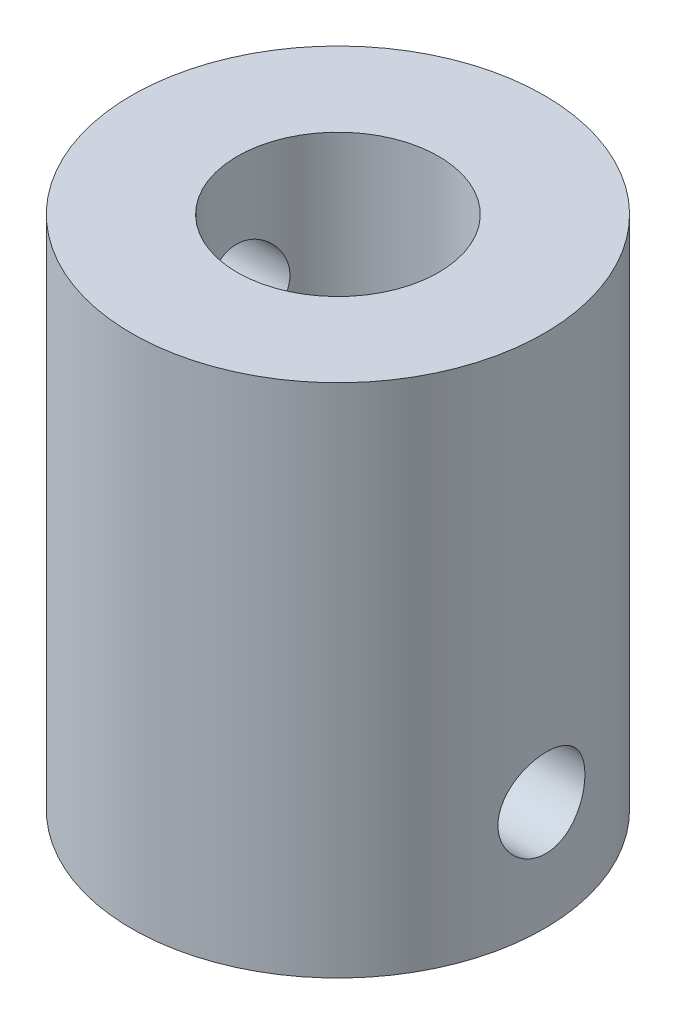
ISO-10303-21;
HEADER;
FILE_DESCRIPTION(('STEP AP214'),'2;1');
FILE_NAME('part.step','',(''),(''),'','','');
FILE_SCHEMA(('AUTOMOTIVE_DESIGN { 1 0 10303 214 1 1 1 1 }'));
ENDSEC;
DATA;
#1=APPLICATION_CONTEXT('core data for automotive mechanical design processes');
#2=APPLICATION_PROTOCOL_DEFINITION('international standard','automotive_design',2000,#1);
#3=PRODUCT_CONTEXT('',#1,'mechanical');
#4=PRODUCT('Part','Part','',(#3));
#5=PRODUCT_RELATED_PRODUCT_CATEGORY('part','',(#4));
#6=PRODUCT_DEFINITION_FORMATION('','',#4);
#7=PRODUCT_DEFINITION_CONTEXT('part definition',#1,'design');
#8=PRODUCT_DEFINITION('design','',#6,#7);
#9=PRODUCT_DEFINITION_SHAPE('','',#8);
#10=(LENGTH_UNIT() NAMED_UNIT(*) SI_UNIT(.MILLI.,.METRE.));
#11=(NAMED_UNIT(*) PLANE_ANGLE_UNIT() SI_UNIT($,.RADIAN.));
#12=(NAMED_UNIT(*) SI_UNIT($,.STERADIAN.) SOLID_ANGLE_UNIT());
#13=UNCERTAINTY_MEASURE_WITH_UNIT(LENGTH_MEASURE(1.E-05),#10,'distance_accuracy_value','');
#14=(GEOMETRIC_REPRESENTATION_CONTEXT(3) GLOBAL_UNCERTAINTY_ASSIGNED_CONTEXT((#13)) GLOBAL_UNIT_ASSIGNED_CONTEXT((#10,
#11,#12)) REPRESENTATION_CONTEXT('',''));
#15=CARTESIAN_POINT('',(0.,0.,0.));
#16=DIRECTION('',(0.,0.,1.));
#17=DIRECTION('',(1.,0.,0.));
#18=AXIS2_PLACEMENT_3D('',#15,#16,#17);
#19=CARTESIAN_POINT('',(0.,-15.875,0.));
#20=DIRECTION('',(0.,1.,0.));
#21=DIRECTION('',(0.,0.,1.));
#22=AXIS2_PLACEMENT_3D('',#19,#20,#21);
#23=CYLINDRICAL_SURFACE('',#22,6.35);
#24=CARTESIAN_POINT('',(6.21738177406236,-12.5453221322497,1.29099336774329));
#25=CARTESIAN_POINT('',(6.21738326186655,-12.4702792930117,1.2909907076367));
#26=CARTESIAN_POINT('',(6.21869592187058,-12.3952041913741,1.28471345774189));
#27=CARTESIAN_POINT('',(6.22379045246098,-12.2471854645976,1.25979687149708));
#28=CARTESIAN_POINT('',(6.22757416801804,-12.1742434746581,1.24114829814893));
#29=CARTESIAN_POINT('',(6.23714750991711,-12.0326536198847,1.19210333315079));
#30=CARTESIAN_POINT('',(6.24293499962672,-11.9640012726663,1.16171945093561));
#31=CARTESIAN_POINT('',(6.25583609295879,-11.8327581574019,1.0901067360321));
#32=CARTESIAN_POINT('',(6.26294965467079,-11.770167197881,1.04887824607021));
#33=CARTESIAN_POINT('',(6.27779468396373,-11.6518188811392,0.956048613447214));
#34=CARTESIAN_POINT('',(6.28553356927118,-11.5961728010964,0.904306766010363));
#35=CARTESIAN_POINT('',(6.30063985111885,-11.494267426295,0.792230481802911));
#36=CARTESIAN_POINT('',(6.30800721966741,-11.4480088380387,0.73189539888681));
#37=CARTESIAN_POINT('',(6.32157833558068,-11.3657540041882,0.603607869396303));
#38=CARTESIAN_POINT('',(6.32776978282993,-11.3298643862855,0.535585639147176));
#39=CARTESIAN_POINT('',(6.33813990311477,-11.2700555460559,0.39432394261325));
#40=CARTESIAN_POINT('',(6.34231879015412,-11.2461350509925,0.321085031990501));
#41=CARTESIAN_POINT('',(6.34808099807122,-11.2112923359577,0.172629986919483));
#42=CARTESIAN_POINT('',(6.34970203279303,-11.2001819130496,0.0974595184543244));
#43=CARTESIAN_POINT('',(6.3502225308924,-11.1906866866706,-0.053686497890084));
#44=CARTESIAN_POINT('',(6.34912229018535,-11.1923004995897,-0.129661957338898));
#45=CARTESIAN_POINT('',(6.34430217633988,-11.2080669538146,-0.278965828647051));
#46=CARTESIAN_POINT('',(6.34062487461048,-11.2220167793994,-0.352317172565448));
#47=CARTESIAN_POINT('',(6.33103849154393,-11.2617365539936,-0.495590567584669));
#48=CARTESIAN_POINT('',(6.32512931279723,-11.2875070189214,-0.565512468858087));
#49=CARTESIAN_POINT('',(6.31160990517074,-11.3503186001684,-0.700513687389734));
#50=CARTESIAN_POINT('',(6.30398805023243,-11.3874374039617,-0.765555650680673));
#51=CARTESIAN_POINT('',(6.28783189586731,-11.4718342101457,-0.888551494520052));
#52=CARTESIAN_POINT('',(6.27929747823784,-11.5191135294132,-0.946504454752822));
#53=CARTESIAN_POINT('',(6.26201157221647,-11.6235961544228,-1.05488722654952));
#54=CARTESIAN_POINT('',(6.25325912496787,-11.6809769723287,-1.10514590506409));
#55=CARTESIAN_POINT('',(6.23664279521635,-11.8034514460884,-1.1953649137026));
#56=CARTESIAN_POINT('',(6.22877893435493,-11.8685452897137,-1.23532499303466));
#57=CARTESIAN_POINT('',(6.214789312092,-12.0048649231218,-1.30388932195032));
#58=CARTESIAN_POINT('',(6.20866828157541,-12.0761067319225,-1.3324627449862));
#59=CARTESIAN_POINT('',(6.19889805673559,-12.2225440782345,-1.37720468359972));
#60=CARTESIAN_POINT('',(6.19524849261453,-12.2977390224352,-1.39337505505539));
#61=CARTESIAN_POINT('',(6.19089466555298,-12.4483885629586,-1.41259316675393));
#62=CARTESIAN_POINT('',(6.19013475457655,-12.5238099544007,-1.41588887758296));
#63=CARTESIAN_POINT('',(6.19149359428071,-12.6741257884309,-1.40993479896112));
#64=CARTESIAN_POINT('',(6.19361215819128,-12.749020264891,-1.40068582347301));
#65=CARTESIAN_POINT('',(6.20044475689727,-12.8953004715963,-1.37011790690533));
#66=CARTESIAN_POINT('',(6.20512968128383,-12.9667159488616,-1.3489342662147));
#67=CARTESIAN_POINT('',(6.21655858579892,-13.1049763898437,-1.29524057701489));
#68=CARTESIAN_POINT('',(6.22330275453617,-13.1718209342164,-1.26272949097255));
#69=CARTESIAN_POINT('',(6.23824061612408,-13.30012124665,-1.1867473869029));
#70=CARTESIAN_POINT('',(6.24645410608942,-13.3614836697538,-1.14312271124506));
#71=CARTESIAN_POINT('',(6.26339086613724,-13.4760946954109,-1.04634726376692));
#72=CARTESIAN_POINT('',(6.27211419601588,-13.5293423435766,-0.993195373037772));
#73=CARTESIAN_POINT('',(6.28931779645379,-13.6271698489464,-0.877747464435722));
#74=CARTESIAN_POINT('',(6.29779108997635,-13.6715807154957,-0.815307013208527));
#75=CARTESIAN_POINT('',(6.31343375575425,-13.7492686262381,-0.683695285842192));
#76=CARTESIAN_POINT('',(6.32060318713189,-13.7825461753176,-0.614524315110042));
#77=CARTESIAN_POINT('',(6.33284841238688,-13.8367840054222,-0.47182870186883));
#78=CARTESIAN_POINT('',(6.33793700362864,-13.8578199230631,-0.398333951453581));
#79=CARTESIAN_POINT('',(6.34556855147914,-13.8872147258775,-0.248726196795455));
#80=CARTESIAN_POINT('',(6.34811185802466,-13.8955753537862,-0.172613553960522));
#81=CARTESIAN_POINT('',(6.35040412025656,-13.8993072952895,-0.0215362150461854));
#82=CARTESIAN_POINT('',(6.35020718148454,-13.8949314598081,0.0534215268750214));
#83=CARTESIAN_POINT('',(6.34723343966858,-13.8738779699891,0.201532728771565));
#84=CARTESIAN_POINT('',(6.34445667841879,-13.8572005149434,0.274686217956795));
#85=CARTESIAN_POINT('',(6.33669756266551,-13.8121356782574,0.416925760686592));
#86=CARTESIAN_POINT('',(6.33172163731786,-13.7837824465873,0.486023010286181));
#87=CARTESIAN_POINT('',(6.32015417960372,-13.7162048806108,0.618530436011767));
#88=CARTESIAN_POINT('',(6.31356249930294,-13.6769795508405,0.681940090669888));
#89=CARTESIAN_POINT('',(6.29938396433424,-13.5879377986203,0.80250689924097));
#90=CARTESIAN_POINT('',(6.29178126038325,-13.5379425749467,0.859530153004304));
#91=CARTESIAN_POINT('',(6.27655359761027,-13.4291430406913,0.964465159692942));
#92=CARTESIAN_POINT('',(6.26892863389397,-13.3703366230238,1.01237472695855));
#93=CARTESIAN_POINT('',(6.25445297993725,-13.2446981833297,1.09829184678259));
#94=CARTESIAN_POINT('',(6.24761319143143,-13.1777748130402,1.13616777118831));
#95=CARTESIAN_POINT('',(6.23565741707973,-13.0383866487961,1.20005887447763));
#96=CARTESIAN_POINT('',(6.23053994001416,-12.9659267155898,1.22608432072501));
#97=CARTESIAN_POINT('',(6.22360171398538,-12.8353565593221,1.26075750965509));
#98=CARTESIAN_POINT('',(6.22128490724863,-12.777966651088,1.27207456724318));
#99=CARTESIAN_POINT('',(6.21817439147064,-12.6621650293446,1.28719336704435));
#100=CARTESIAN_POINT('',(6.21738061560104,-12.6037533607822,1.29099543900415));
#101=CARTESIAN_POINT('',(6.21738177406236,-12.5453221322497,1.29099336774329));
#102=B_SPLINE_CURVE_WITH_KNOTS('',3,(#24,#25,#26,#27,#28,#29,#30,#31,#32,#33,#34,#35,#36,#37,
#38,#39,#40,#41,#42,#43,#44,#45,#46,#47,#48,#49,#50,#51,#52,#53,#54,#55,#56,#57,#58,#59,#60,#61,
#62,#63,#64,#65,#66,#67,#68,#69,#70,#71,#72,#73,#74,#75,#76,#77,#78,#79,#80,#81,#82,#83,#84,#85,
#86,#87,#88,#89,#90,#91,#92,#93,#94,#95,#96,#97,#98,#99,#100,#101),.UNSPECIFIED.,.T.,.F.,(4,2,2,
2,2,2,2,2,2,2,2,2,2,2,2,2,2,2,2,2,2,2,2,2,2,2,2,2,2,2,2,2,2,2,2,2,2,2,4),(0.,0.224914436969691,
0.449996994676308,0.674840281381522,0.899676463128612,1.12774753758039,1.3558357702931,
1.58619220951851,1.81652414859101,2.04342715592709,2.27030549058829,2.49352167317423,
2.71674759908275,2.9415372454847,3.16635604385125,3.39561376672705,3.62487707196821,
3.85475690153272,4.08460232728992,4.30999836392226,4.53537977641819,4.75825607317155,
4.98115278956581,5.20731655186001,5.43350689302726,5.66367697281435,5.89383661316975,
6.12255865319632,6.35124924320268,6.57543090537501,6.79960893577978,7.02313588295605,
7.24668330332533,7.47427578777838,7.70192278522308,7.93242289796555,8.16272292149834,
8.33785760045705,8.5129845945886),.UNSPECIFIED.);
#103=CARTESIAN_POINT('',(6.21738177406236,-12.5453221322497,1.29099336774329));
#104=VERTEX_POINT('',#103);
#105=EDGE_CURVE('E40',#104,#104,#102,.T.);
#106=ORIENTED_EDGE('',*,*,#105,.T.);
#107=EDGE_LOOP('',(#106));
#108=FACE_BOUND('',#107,.T.);
#109=CARTESIAN_POINT('',(-6.19057171593755,-12.5453221322497,1.4139737726825));
#110=CARTESIAN_POINT('',(-6.19057325617514,-12.6203649714876,1.4139711425881));
#111=CARTESIAN_POINT('',(-6.1920100789669,-12.6954400731253,1.40772114396466));
#112=CARTESIAN_POINT('',(-6.19759747757342,-12.8434587999018,1.38291043077773));
#113=CARTESIAN_POINT('',(-6.2017500810819,-12.9164007898412,1.36434051759971));
#114=CARTESIAN_POINT('',(-6.21229365700115,-13.0579906446147,1.31549493976895));
#115=CARTESIAN_POINT('',(-6.21868224525117,-13.126642991833,1.28523173974357));
#116=CARTESIAN_POINT('',(-6.23300023168795,-13.2578861070974,1.2138888044983));
#117=CARTESIAN_POINT('',(-6.24092958117936,-13.3204770666184,1.17280941110684));
#118=CARTESIAN_POINT('',(-6.25761165982361,-13.4388253833601,1.08029225680702));
#119=CARTESIAN_POINT('',(-6.26637459413926,-13.494471463403,1.02871396579074));
#120=CARTESIAN_POINT('',(-6.28369935972983,-13.5963768382044,0.916959119228086));
#121=CARTESIAN_POINT('',(-6.29226117582575,-13.6426354264607,0.856781917108323));
#122=CARTESIAN_POINT('',(-6.30837239833868,-13.7248902603111,0.728788581660543));
#123=CARTESIAN_POINT('',(-6.315910890231,-13.7607798782138,0.660902434567819));
#124=CARTESIAN_POINT('',(-6.32907890546611,-13.8205887184435,0.51987403431761));
#125=CARTESIAN_POINT('',(-6.3347086317569,-13.8445092135068,0.446732340954759));
#126=CARTESIAN_POINT('',(-6.34341221841485,-13.8793519285416,0.298420672410421));
#127=CARTESIAN_POINT('',(-6.34652288007675,-13.8904623514498,0.223297101762682));
#128=CARTESIAN_POINT('',(-6.35003912410586,-13.8999575778288,0.0721910952540607));
#129=CARTESIAN_POINT('',(-6.35044500057757,-13.8983437649096,-0.00379124632845132));
#130=CARTESIAN_POINT('',(-6.34858516889207,-13.8825773106847,-0.153161325364336));
#131=CARTESIAN_POINT('',(-6.34636247831435,-13.8686274850999,-0.226571146568584));
#132=CARTESIAN_POINT('',(-6.33961778436408,-13.8289077105058,-0.370006405707158));
#133=CARTESIAN_POINT('',(-6.33509568063141,-13.803137245578,-0.440031695774253));
#134=CARTESIAN_POINT('',(-6.32425477289664,-13.7403256643309,-0.575274359557126));
#135=CARTESIAN_POINT('',(-6.31792360473121,-13.7032068605376,-0.640454617082711));
#136=CARTESIAN_POINT('',(-6.3042085110739,-13.6188100543536,-0.763746527326658));
#137=CARTESIAN_POINT('',(-6.2968244491611,-13.5715307350861,-0.821857262253031));
#138=CARTESIAN_POINT('',(-6.28169018173402,-13.4670481100766,-0.930561363917873));
#139=CARTESIAN_POINT('',(-6.2739356255425,-13.4096672921706,-0.980983650231993));
#140=CARTESIAN_POINT('',(-6.25911078093915,-13.2871928184109,-1.07151428547009));
#141=CARTESIAN_POINT('',(-6.25204050919366,-13.2220989747856,-1.1116223832225));
#142=CARTESIAN_POINT('',(-6.23941264108388,-13.0857793413776,-1.18045052919285));
#143=CARTESIAN_POINT('',(-6.23385916366558,-13.0145375325769,-1.20913966314871));
#144=CARTESIAN_POINT('',(-6.22497768314754,-12.8681001862649,-1.25406646659748));
#145=CARTESIAN_POINT('',(-6.22164934710778,-12.7929052420642,-1.27030599893355));
#146=CARTESIAN_POINT('',(-6.21767729539857,-12.6422557015407,-1.28960663189102));
#147=CARTESIAN_POINT('',(-6.21698285762251,-12.5668343100986,-1.29291675737744));
#148=CARTESIAN_POINT('',(-6.218223415256,-12.4165184760685,-1.28693691504385));
#149=CARTESIAN_POINT('',(-6.22015824006569,-12.3416239996084,-1.27764776472863));
#150=CARTESIAN_POINT('',(-6.22638361325174,-12.195343792903,-1.24695042515238));
#151=CARTESIAN_POINT('',(-6.23064773871187,-12.1239283156377,-1.22567808669424));
#152=CARTESIAN_POINT('',(-6.2410101414113,-11.9856678746557,-1.171768414755));
#153=CARTESIAN_POINT('',(-6.24710858665744,-11.918823330283,-1.13913004020618));
#154=CARTESIAN_POINT('',(-6.26053748092097,-11.7905230178494,-1.06286678138171));
#155=CARTESIAN_POINT('',(-6.26788467753323,-11.7291605947456,-1.01908787726565));
#156=CARTESIAN_POINT('',(-6.28289993504684,-11.6145495690885,-0.921995740007724));
#157=CARTESIAN_POINT('',(-6.29056803355483,-11.5613019209227,-0.868681386991609));
#158=CARTESIAN_POINT('',(-6.30547997428598,-11.463474415553,-0.752915167859059));
#159=CARTESIAN_POINT('',(-6.31271397804581,-11.4190635490037,-0.690319035053766));
#160=CARTESIAN_POINT('',(-6.32574490953438,-11.3413756382613,-0.558423111699291));
#161=CARTESIAN_POINT('',(-6.33154190242724,-11.3080980891818,-0.489123625325245));
#162=CARTESIAN_POINT('',(-6.3409563683758,-11.2538602590772,-0.346213333845819));
#163=CARTESIAN_POINT('',(-6.34458722876966,-11.2328243414362,-0.272632161306739));
#164=CARTESIAN_POINT('',(-6.34925191890761,-11.2034295386219,-0.122902533502628));
#165=CARTESIAN_POINT('',(-6.35028610568318,-11.1950689107132,-0.0467544326384844));
#166=CARTESIAN_POINT('',(-6.34958343065749,-11.1913369692099,0.104338661337995));
#167=CARTESIAN_POINT('',(-6.34790080160623,-11.1957128046912,0.179277774078153));
#168=CARTESIAN_POINT('',(-6.34199194852353,-11.2167662945103,0.327300936869905));
#169=CARTESIAN_POINT('',(-6.33776576569905,-11.233443749556,0.400385016954052));
#170=CARTESIAN_POINT('',(-6.32718886027618,-11.2785085862419,0.542442823726261));
#171=CARTESIAN_POINT('',(-6.32084434365484,-11.3068618179121,0.61142787170142));
#172=CARTESIAN_POINT('',(-6.30665274362775,-11.3744393838886,0.743679988656351));
#173=CARTESIAN_POINT('',(-6.29880552265271,-11.4136647136589,0.806946533338503));
#174=CARTESIAN_POINT('',(-6.2822400319543,-11.502706465879,0.927208625041565));
#175=CARTESIAN_POINT('',(-6.27350857008132,-11.5527016895527,0.984069984071089));
#176=CARTESIAN_POINT('',(-6.25620399386928,-11.661501223808,1.08868255016328));
#177=CARTESIAN_POINT('',(-6.24763091795859,-11.7203076414755,1.13643157189863));
#178=CARTESIAN_POINT('',(-6.23145515422403,-11.8459460811697,1.22204489273095));
#179=CARTESIAN_POINT('',(-6.22386597497988,-11.9128694514592,1.25977780561601));
#180=CARTESIAN_POINT('',(-6.21064617100761,-12.0522576157033,1.32341938324267));
#181=CARTESIAN_POINT('',(-6.2050138518445,-12.1247175489095,1.34933828377369));
#182=CARTESIAN_POINT('',(-6.19738973547524,-12.2552877051773,1.38386713925132));
#183=CARTESIAN_POINT('',(-6.19484906975725,-12.3126776134114,1.39513605240286));
#184=CARTESIAN_POINT('',(-6.19143949701997,-12.4284792351547,1.4101902288859));
#185=CARTESIAN_POINT('',(-6.19057051664959,-12.4868909037171,1.41397582057473));
#186=CARTESIAN_POINT('',(-6.19057171593755,-12.5453221322497,1.4139737726825));
#187=B_SPLINE_CURVE_WITH_KNOTS('',3,(#109,#110,#111,#112,#113,#114,#115,#116,#117,#118,#119,
#120,#121,#122,#123,#124,#125,#126,#127,#128,#129,#130,#131,#132,#133,#134,#135,#136,#137,#138,
#139,#140,#141,#142,#143,#144,#145,#146,#147,#148,#149,#150,#151,#152,#153,#154,#155,#156,#157,
#158,#159,#160,#161,#162,#163,#164,#165,#166,#167,#168,#169,#170,#171,#172,#173,#174,#175,#176,
#177,#178,#179,#180,#181,#182,#183,#184,#185,#186),.UNSPECIFIED.,.T.,.F.,(4,2,2,2,2,2,2,2,2,2,2,
2,2,2,2,2,2,2,2,2,2,2,2,2,2,2,2,2,2,2,2,2,2,2,2,2,2,2,4),(0.,0.224914436969691,
0.449996994676308,0.67484028138152,0.89967646312861,1.12774753758039,1.3558357702931,
1.58619220951851,1.81652414859101,2.04342715592709,2.27030549058829,2.49352167317423,
2.71674759908275,2.9415372454847,3.16635604385125,3.39561376672705,3.62487707196821,
3.85475690153272,4.08460232728992,4.30999836392226,4.53537977641818,4.75825607317155,
4.98115278956581,5.20731655186,5.43350689302726,5.66367697281435,5.89383661316975,
6.12255865319632,6.35124924320268,6.57543090537501,6.79960893577978,7.02313588295605,
7.24668330332533,7.47427578777838,7.70192278522308,7.93242289796555,8.16272292149834,
8.33785760045705,8.5129845945886),.UNSPECIFIED.);
#188=CARTESIAN_POINT('',(-6.19057171593755,-12.5453221322497,1.4139737726825));
#189=VERTEX_POINT('',#188);
#190=EDGE_CURVE('E10',#189,#189,#187,.T.);
#191=ORIENTED_EDGE('',*,*,#190,.T.);
#192=EDGE_LOOP('',(#191));
#193=FACE_BOUND('',#192,.T.);
#194=CARTESIAN_POINT('',(-6.19089586229592,-3.68506928589036,1.41255386524098));
#195=CARTESIAN_POINT('',(-6.19089740193022,-3.76011212512833,1.41255123479338));
#196=CARTESIAN_POINT('',(-6.19233279118379,-3.83518722676597,1.40630090678448));
#197=CARTESIAN_POINT('',(-6.19791449905527,-3.98320595354244,1.38148891272376));
#198=CARTESIAN_POINT('',(-6.20206284325708,-4.0561479434819,1.36291804759256));
#199=CARTESIAN_POINT('',(-6.21259521567158,-4.19773779825536,1.31407005277079));
#200=CARTESIAN_POINT('',(-6.21897686258248,-4.26639014547373,1.28380538825407));
#201=CARTESIAN_POINT('',(-6.23327848541872,-4.39763326073813,1.21245917091031));
#202=CARTESIAN_POINT('',(-6.2411984127271,-4.46022422025908,1.17137795992283));
#203=CARTESIAN_POINT('',(-6.25785927118729,-4.5785725370008,1.07885698185299));
#204=CARTESIAN_POINT('',(-6.26661037526961,-4.63421861704364,1.02727668232574));
#205=CARTESIAN_POINT('',(-6.28390950829986,-4.73612399184508,0.915517865092326));
#206=CARTESIAN_POINT('',(-6.2924575219205,-4.78238258010138,0.855338700816268));
#207=CARTESIAN_POINT('',(-6.30853938744333,-4.86463741395182,0.727341673463229));
#208=CARTESIAN_POINT('',(-6.31606230876275,-4.9005270318545,0.659453799126737));
#209=CARTESIAN_POINT('',(-6.3291979773612,-4.96033587208418,0.518422382368495));
#210=CARTESIAN_POINT('',(-6.33481092771661,-4.98425636714749,0.445279399694814));
#211=CARTESIAN_POINT('',(-6.34348049736405,-5.01909908218232,0.296965738795874));
#212=CARTESIAN_POINT('',(-6.34657392859323,-5.03020950509048,0.22184145666239));
#213=CARTESIAN_POINT('',(-6.3500555148386,-5.03970473146948,0.0707346476421746));
#214=CARTESIAN_POINT('',(-6.35044396398091,-5.0380909185503,-0.00524778503364653));
#215=CARTESIAN_POINT('',(-6.34854987280561,-5.02232446432541,-0.154617433569434));
#216=CARTESIAN_POINT('',(-6.34631034500122,-5.00837463874059,-0.228026743046212));
#217=CARTESIAN_POINT('',(-6.33953275290061,-4.96865486414644,-0.371460451448214));
#218=CARTESIAN_POINT('',(-6.3349945882782,-4.94288439921869,-0.441484702483194));
#219=CARTESIAN_POINT('',(-6.32412266155546,-4.88007281797159,-0.576724876236914));
#220=CARTESIAN_POINT('',(-6.31777654380511,-4.84295401417829,-0.641903679930593));
#221=CARTESIAN_POINT('',(-6.30403317226165,-4.75855720799429,-0.765192441236112));
#222=CARTESIAN_POINT('',(-6.29663578225813,-4.7112778887268,-0.823301481024696));
#223=CARTESIAN_POINT('',(-6.28147658284372,-4.60679526371728,-0.932002108632952));
#224=CARTESIAN_POINT('',(-6.27371046199471,-4.54941444581129,-0.982422615034901));
#225=CARTESIAN_POINT('',(-6.25886485366425,-4.4269399720516,-1.07294984766368));
#226=CARTESIAN_POINT('',(-6.25178538290676,-4.36184612842633,-1.11305632272278));
#227=CARTESIAN_POINT('',(-6.23914172869756,-4.22552649501827,-1.18188157055344));
#228=CARTESIAN_POINT('',(-6.23358167128223,-4.15428468621755,-1.21056943000846));
#229=CARTESIAN_POINT('',(-6.22468988658093,-4.00784733990556,-1.25549419521811));
#230=CARTESIAN_POINT('',(-6.22135782592768,-3.93265239570488,-1.2717329637395));
#231=CARTESIAN_POINT('',(-6.21738134752753,-3.78200285518139,-1.29103268515906));
#232=CARTESIAN_POINT('',(-6.21668615055897,-3.70658146373931,-1.29434265128208));
#233=CARTESIAN_POINT('',(-6.21792807969716,-3.55626562970914,-1.28836309364022));
#234=CARTESIAN_POINT('',(-6.21986503501655,-3.48137115324908,-1.27907438734098));
#235=CARTESIAN_POINT('',(-6.22609744878424,-3.33509094654372,-1.24837847642448));
#236=CARTESIAN_POINT('',(-6.23036645315824,-3.26367546927841,-1.22710711654618));
#237=CARTESIAN_POINT('',(-6.24074122031373,-3.12541502829635,-1.17319982274682));
#238=CARTESIAN_POINT('',(-6.24684715134085,-3.05857048392366,-1.1405628477966));
#239=CARTESIAN_POINT('',(-6.26029353700109,-2.93027017149004,-1.06430267103083));
#240=CARTESIAN_POINT('',(-6.26765077455465,-2.86890774838625,-1.02052545322016));
#241=CARTESIAN_POINT('',(-6.28268830073721,-2.75429672272915,-0.923436762417268));
#242=CARTESIAN_POINT('',(-6.29036862722973,-2.70104907456338,-0.870124169559448));
#243=CARTESIAN_POINT('',(-6.30530711972215,-2.60322156919365,-0.754361373676363));
#244=CARTESIAN_POINT('',(-6.31255548034802,-2.55881070264434,-0.691766901709483));
#245=CARTESIAN_POINT('',(-6.32561666315818,-2.48112279190195,-0.559873970600233));
#246=CARTESIAN_POINT('',(-6.33142955043682,-2.44784524282244,-0.490575815647939));
#247=CARTESIAN_POINT('',(-6.34087679405885,-2.39360741271783,-0.347667687230493));
#248=CARTESIAN_POINT('',(-6.34452453094351,-2.37257149507691,-0.274087349401384));
#249=CARTESIAN_POINT('',(-6.34922356296364,-2.34317669226253,-0.124358795429489));
#250=CARTESIAN_POINT('',(-6.35027521504929,-2.33481606435383,-0.0482109337694703));
#251=CARTESIAN_POINT('',(-6.34960719477171,-2.33108412285055,0.102882317398429));
#252=CARTESIAN_POINT('',(-6.34794175380834,-2.33545995833192,0.177821814095456));
#253=CARTESIAN_POINT('',(-6.34206685149091,-2.35651344815094,0.325846328248983));
#254=CARTESIAN_POINT('',(-6.33785743135072,-2.37319090319663,0.398931375728582));
#255=CARTESIAN_POINT('',(-6.32731310860115,-2.41825573988259,0.5409916046845));
#256=CARTESIAN_POINT('',(-6.32098441456534,-2.44660897155273,0.609978106024215));
#257=CARTESIAN_POINT('',(-6.30682314827247,-2.51418653752924,0.74223347448755));
#258=CARTESIAN_POINT('',(-6.29899043832589,-2.55341186729954,0.805501817345117));
#259=CARTESIAN_POINT('',(-6.28245253139057,-2.64245361951969,0.925767705347798));
#260=CARTESIAN_POINT('',(-6.27373411147517,-2.69244884319335,0.982631065530808));
#261=CARTESIAN_POINT('',(-6.25645352966865,-2.8012483774487,1.08724759785099));
#262=CARTESIAN_POINT('',(-6.24789140570464,-2.8600547951162,1.13499858465208));
#263=CARTESIAN_POINT('',(-6.23173527867678,-2.98569323481037,1.22061561330756));
#264=CARTESIAN_POINT('',(-6.22415475405755,-3.05261660509986,1.25835026585517));
#265=CARTESIAN_POINT('',(-6.21094954727265,-3.19200476934393,1.32199487390365));
#266=CARTESIAN_POINT('',(-6.20532317301973,-3.26446470255018,1.3479150655823));
#267=CARTESIAN_POINT('',(-6.19770697639332,-3.39503485881795,1.38244566881994));
#268=CARTESIAN_POINT('',(-6.1951688953814,-3.45242476705207,1.39371516440246));
#269=CARTESIAN_POINT('',(-6.19176277556147,-3.56822638879542,1.40877012250952));
#270=CARTESIAN_POINT('',(-6.19089466347769,-3.62663805735781,1.41255591340821));
#271=CARTESIAN_POINT('',(-6.19089586229592,-3.68506928589036,1.41255386524098));
#272=B_SPLINE_CURVE_WITH_KNOTS('',3,(#194,#195,#196,#197,#198,#199,#200,#201,#202,#203,#204,
#205,#206,#207,#208,#209,#210,#211,#212,#213,#214,#215,#216,#217,#218,#219,#220,#221,#222,#223,
#224,#225,#226,#227,#228,#229,#230,#231,#232,#233,#234,#235,#236,#237,#238,#239,#240,#241,#242,
#243,#244,#245,#246,#247,#248,#249,#250,#251,#252,#253,#254,#255,#256,#257,#258,#259,#260,#261,
#262,#263,#264,#265,#266,#267,#268,#269,#270,#271),.UNSPECIFIED.,.T.,.F.,(4,2,2,2,2,2,2,2,2,2,2,
2,2,2,2,2,2,2,2,2,2,2,2,2,2,2,2,2,2,2,2,2,2,2,2,2,2,2,4),(0.,0.224914436969694,
0.449996994676309,0.674840281381522,0.899676463128613,1.1277475375804,1.35583577029311,
1.58619220951851,1.81652414859102,2.0434271559271,2.2703054905883,2.49352167317424,
2.71674759908276,2.94153724548471,3.16635604385126,3.39561376672706,3.62487707196822,
3.85475690153274,4.08460232728993,4.30999836392228,4.5353797764182,4.75825607317157,
4.98115278956583,5.20731655186002,5.43350689302728,5.66367697281437,5.89383661316977,
6.12255865319635,6.3512492432027,6.57543090537504,6.79960893577981,7.02313588295608,
7.24668330332536,7.47427578777841,7.70192278522311,7.93242289796558,8.16272292149837,
8.33785760045708,8.51298459458864),.UNSPECIFIED.);
#273=CARTESIAN_POINT('',(-6.19089586229592,-3.68506928589036,1.41255386524098));
#274=VERTEX_POINT('',#273);
#275=EDGE_CURVE('E48',#274,#274,#272,.T.);
#276=ORIENTED_EDGE('',*,*,#275,.T.);
#277=EDGE_LOOP('',(#276));
#278=FACE_BOUND('',#277,.T.);
#279=CARTESIAN_POINT('',(0.,-15.875,0.));
#280=DIRECTION('',(0.,-1.,0.));
#281=DIRECTION('',(0.,0.,-1.));
#282=AXIS2_PLACEMENT_3D('',#279,#280,#281);
#283=CIRCLE('',#282,6.35);
#284=CARTESIAN_POINT('',(0.,-15.875,-6.35));
#285=VERTEX_POINT('',#284);
#286=EDGE_CURVE('E52',#285,#285,#283,.T.);
#287=ORIENTED_EDGE('',*,*,#286,.F.);
#288=EDGE_LOOP('',(#287));
#289=FACE_BOUND('',#288,.T.);
#290=CARTESIAN_POINT('',(0.,0.,0.));
#291=DIRECTION('',(0.,-1.,0.));
#292=DIRECTION('',(0.,0.,-1.));
#293=AXIS2_PLACEMENT_3D('',#290,#291,#292);
#294=CIRCLE('',#293,6.35);
#295=CARTESIAN_POINT('',(0.,0.,-6.35));
#296=VERTEX_POINT('',#295);
#297=EDGE_CURVE('E120',#296,#296,#294,.T.);
#298=ORIENTED_EDGE('',*,*,#297,.T.);
#299=EDGE_LOOP('',(#298));
#300=FACE_BOUND('',#299,.T.);
#301=ADVANCED_FACE('F36',(#108,#193,#278,#289,#300),#23,.T.);
#302=CARTESIAN_POINT('',(0.,-15.875,0.));
#303=DIRECTION('',(0.,-1.,0.));
#304=DIRECTION('',(0.,0.,-1.));
#305=AXIS2_PLACEMENT_3D('',#302,#303,#304);
#306=PLANE('',#305);
#307=CARTESIAN_POINT('',(0.,-15.875,0.));
#308=DIRECTION('',(0.,-1.,0.));
#309=DIRECTION('',(0.,0.,-1.));
#310=AXIS2_PLACEMENT_3D('',#307,#308,#309);
#311=CIRCLE('',#310,4.1);
#312=CARTESIAN_POINT('',(0.,-15.875,-4.1));
#313=VERTEX_POINT('',#312);
#314=EDGE_CURVE('E108',#313,#313,#311,.T.);
#315=ORIENTED_EDGE('',*,*,#314,.F.);
#316=EDGE_LOOP('',(#315));
#317=FACE_BOUND('',#316,.T.);
#318=ORIENTED_EDGE('',*,*,#286,.T.);
#319=EDGE_LOOP('',(#318));
#320=FACE_BOUND('',#319,.T.);
#321=ADVANCED_FACE('F101',(#317,#320),#306,.T.);
#322=CARTESIAN_POINT('',(0.,0.,0.));
#323=DIRECTION('',(0.,-1.,0.));
#324=DIRECTION('',(0.,0.,-1.));
#325=AXIS2_PLACEMENT_3D('',#322,#323,#324);
#326=PLANE('',#325);
#327=CARTESIAN_POINT('',(0.,0.,0.));
#328=DIRECTION('',(0.,1.,0.));
#329=DIRECTION('',(0.,0.,1.));
#330=AXIS2_PLACEMENT_3D('',#327,#328,#329);
#331=CIRCLE('',#330,3.1);
#332=CARTESIAN_POINT('',(0.,0.,3.1));
#333=VERTEX_POINT('',#332);
#334=EDGE_CURVE('E117',#333,#333,#331,.T.);
#335=ORIENTED_EDGE('',*,*,#334,.F.);
#336=EDGE_LOOP('',(#335));
#337=FACE_BOUND('',#336,.T.);
#338=ORIENTED_EDGE('',*,*,#297,.F.);
#339=EDGE_LOOP('',(#338));
#340=FACE_BOUND('',#339,.T.);
#341=ADVANCED_FACE('F99',(#337,#340),#326,.F.);
#342=CARTESIAN_POINT('',(0.,-9.525,0.));
#343=DIRECTION('',(0.,1.,0.));
#344=DIRECTION('',(0.,0.,1.));
#345=AXIS2_PLACEMENT_3D('',#342,#343,#344);
#346=CYLINDRICAL_SURFACE('',#345,3.1);
#347=CARTESIAN_POINT('',(-2.77614865830877,-3.68506928589036,1.37949216270714));
#348=CARTESIAN_POINT('',(-2.77615773232735,-3.6132840376681,1.37948329556097));
#349=CARTESIAN_POINT('',(-2.77901603346458,-3.54139685806758,1.37376861793919));
#350=CARTESIAN_POINT('',(-2.79008424817976,-3.39971872244688,1.35113908532706));
#351=CARTESIAN_POINT('',(-2.79830802663743,-3.32993368868698,1.33419521128052));
#352=CARTESIAN_POINT('',(-2.81899478098871,-3.19477508424777,1.28990639105739));
#353=CARTESIAN_POINT('',(-2.83143931676,-3.12938378198679,1.26260662842314));
#354=CARTESIAN_POINT('',(-2.85916085613911,-3.0041461175281,1.19850484450007));
#355=CARTESIAN_POINT('',(-2.874437378996,-2.94429881677696,1.16170443560116));
#356=CARTESIAN_POINT('',(-2.90729705893853,-2.82772262779687,1.07694557764097));
#357=CARTESIAN_POINT('',(-2.9249645266482,-2.7714177043374,1.02843643431096));
#358=CARTESIAN_POINT('',(-2.95999802113609,-2.6674535233435,0.922772373063016));
#359=CARTESIAN_POINT('',(-2.97736392237007,-2.61979779202805,0.865613946225643));
#360=CARTESIAN_POINT('',(-3.01089317418926,-2.53224718702873,0.740868422757724));
#361=CARTESIAN_POINT('',(-3.02695772572161,-2.49283921021485,0.672910620051138));
#362=CARTESIAN_POINT('',(-3.05513121169329,-2.42622668035634,0.530498774130637));
#363=CARTESIAN_POINT('',(-3.06724206230941,-2.39901621334732,0.456047900045857));
#364=CARTESIAN_POINT('',(-3.08559936763381,-2.35913845519804,0.30720911952313));
#365=CARTESIAN_POINT('',(-3.09213808977994,-2.34573738323547,0.233054560420652));
#366=CARTESIAN_POINT('',(-3.09978643501108,-2.33147771849808,0.0832849528081955));
#367=CARTESIAN_POINT('',(-3.10089848700404,-2.33061351404046,0.00767057291295952));
#368=CARTESIAN_POINT('',(-3.09774400971927,-2.34108961247816,-0.137496925192626));
#369=CARTESIAN_POINT('',(-3.09383083226961,-2.35162076456564,-0.207118276942628));
#370=CARTESIAN_POINT('',(-3.0816678610671,-2.38318827868893,-0.343532146930677));
#371=CARTESIAN_POINT('',(-3.07341774645812,-2.40422541797497,-0.410324455474782));
#372=CARTESIAN_POINT('',(-3.05325292428038,-2.456442444164,-0.540416109534609));
#373=CARTESIAN_POINT('',(-3.04128410833918,-2.48777251081764,-0.603646423756968));
#374=CARTESIAN_POINT('',(-3.01486758939584,-2.55952961984393,-0.724143702112714));
#375=CARTESIAN_POINT('',(-3.00041898901522,-2.59995995705627,-0.781408495359985));
#376=CARTESIAN_POINT('',(-2.96920684662907,-2.69234420180698,-0.892982604167934));
#377=CARTESIAN_POINT('',(-2.95235079898728,-2.74494154494892,-0.946733998811714));
#378=CARTESIAN_POINT('',(-2.91905152465713,-2.85837648219137,-1.04490722445698));
#379=CARTESIAN_POINT('',(-2.90260849226263,-2.91921787154013,-1.08932473432378));
#380=CARTESIAN_POINT('',(-2.87139187684209,-3.05038253401214,-1.16919752011749));
#381=CARTESIAN_POINT('',(-2.85670823575414,-3.12098277745456,-1.20423645271893));
#382=CARTESIAN_POINT('',(-2.83182320605182,-3.26788475177398,-1.26165284578265));
#383=CARTESIAN_POINT('',(-2.82161825690994,-3.34418189698008,-1.28404036811187));
#384=CARTESIAN_POINT('',(-2.80778313419685,-3.49469787511122,-1.31400523784071));
#385=CARTESIAN_POINT('',(-2.80374746098332,-3.56869616362505,-1.322498866497));
#386=CARTESIAN_POINT('',(-2.80155313061499,-3.71715286269389,-1.32714361409729));
#387=CARTESIAN_POINT('',(-2.80339208953594,-3.79161107437274,-1.32329973959394));
#388=CARTESIAN_POINT('',(-2.81231348007929,-3.93311901482656,-1.30421867985539));
#389=CARTESIAN_POINT('',(-2.81900243623299,-4.00031220638214,-1.28983564691738));
#390=CARTESIAN_POINT('',(-2.83633813856168,-4.13127302785409,-1.25125132254185));
#391=CARTESIAN_POINT('',(-2.84698587129218,-4.19503979934453,-1.22704758357651));
#392=CARTESIAN_POINT('',(-2.87158985268361,-4.32049219358787,-1.16834239825449));
#393=CARTESIAN_POINT('',(-2.88567137765835,-4.38196176777696,-1.13343362394582));
#394=CARTESIAN_POINT('',(-2.91536392291427,-4.49850652672289,-1.05471386648429));
#395=CARTESIAN_POINT('',(-2.93097564540412,-4.55357875016038,-1.01089878622394));
#396=CARTESIAN_POINT('',(-2.96364589973337,-4.66098202794674,-0.910938057221091));
#397=CARTESIAN_POINT('',(-2.98070697151445,-4.71260905733727,-0.854033663485994));
#398=CARTESIAN_POINT('',(-3.01299879234708,-4.80575712061851,-0.731996353802369));
#399=CARTESIAN_POINT('',(-3.02822932267929,-4.84727694747264,-0.666862456468009));
#400=CARTESIAN_POINT('',(-3.05526161330302,-4.91914640055446,-0.529439410369361));
#401=CARTESIAN_POINT('',(-3.06704004300746,-4.94942037455792,-0.457105809559721));
#402=CARTESIAN_POINT('',(-3.08560396758676,-4.99714729153392,-0.307728617193737));
#403=CARTESIAN_POINT('',(-3.09239275279353,-5.01460868352211,-0.230688165861065));
#404=CARTESIAN_POINT('',(-3.09980286794771,-5.03507765187996,-0.0803539745247261));
#405=CARTESIAN_POINT('',(-3.10085030891908,-5.03907504027073,-0.00721523079558767));
#406=CARTESIAN_POINT('',(-3.09775681187294,-5.03522118652281,0.138629704027234));
#407=CARTESIAN_POINT('',(-3.09361694691352,-5.02737239484362,0.211335981456265));
#408=CARTESIAN_POINT('',(-3.08081861108608,-5.00075773185915,0.351117330827056));
#409=CARTESIAN_POINT('',(-3.07235545557393,-4.98246001514063,0.418300823027732));
#410=CARTESIAN_POINT('',(-3.05179109882175,-4.93600300137927,0.548564721904322));
#411=CARTESIAN_POINT('',(-3.03968924301478,-4.90784192986396,0.611644387856117));
#412=CARTESIAN_POINT('',(-3.0122743123798,-4.84103154542823,0.735109242868454));
#413=CARTESIAN_POINT('',(-2.99683958919873,-4.80196109381554,0.795238868161359));
#414=CARTESIAN_POINT('',(-2.96452221496404,-4.7150303585595,0.908335446364301));
#415=CARTESIAN_POINT('',(-2.94763897203208,-4.66716647263396,0.961299448337906));
#416=CARTESIAN_POINT('',(-2.91267098593472,-4.55975532258066,1.06275158688424));
#417=CARTESIAN_POINT('',(-2.89459193675234,-4.49959824393591,1.11059832942943));
#418=CARTESIAN_POINT('',(-2.86050752345025,-4.37158002158757,1.19566059190976));
#419=CARTESIAN_POINT('',(-2.84450340871064,-4.30371428197992,1.23286972271882));
#420=CARTESIAN_POINT('',(-2.81656203940678,-4.16184820091341,1.2954376165797));
#421=CARTESIAN_POINT('',(-2.80462812964486,-4.08784287586794,1.32078663959261));
#422=CARTESIAN_POINT('',(-2.78661828686971,-3.93604661460839,1.35838550527461));
#423=CARTESIAN_POINT('',(-2.78052270796988,-3.85826930606905,1.37067929388588));
#424=CARTESIAN_POINT('',(-2.77669595794492,-3.74843201335256,1.37838793517335));
#425=CARTESIAN_POINT('',(-2.7761446523685,-3.71676058278331,1.37949607731869));
#426=CARTESIAN_POINT('',(-2.77614865830877,-3.68506928589036,1.37949216270714));
#427=B_SPLINE_CURVE_WITH_KNOTS('',3,(#347,#348,#349,#350,#351,#352,#353,#354,#355,#356,#357,
#358,#359,#360,#361,#362,#363,#364,#365,#366,#367,#368,#369,#370,#371,#372,#373,#374,#375,#376,
#377,#378,#379,#380,#381,#382,#383,#384,#385,#386,#387,#388,#389,#390,#391,#392,#393,#394,#395,
#396,#397,#398,#399,#400,#401,#402,#403,#404,#405,#406,#407,#408,#409,#410,#411,#412,#413,#414,
#415,#416,#417,#418,#419,#420,#421,#422,#423,#424,#425,#426),.UNSPECIFIED.,.T.,.F.,(4,2,2,2,2,2,
2,2,2,2,2,2,2,2,2,2,2,2,2,2,2,2,2,2,2,2,2,2,2,2,2,2,2,2,2,2,2,2,2,4),(0.,0.215258186431048,
0.431074834480632,0.645960490811229,0.860809702046919,1.08899118381219,1.31726548571919,
1.55658152864312,1.79578141331317,2.02148831655176,2.24709418700454,2.45767164882189,
2.66826469181503,2.88207804136238,3.09596892894996,3.32616212704061,3.55646165974538,
3.79572910478074,4.03480598784469,4.25736685488221,4.47983741825054,4.68603122045001,
4.89227644210387,5.1076239189746,5.32307068579516,5.55809820794909,5.79315378413609,
6.02976314005369,6.26621632782575,6.48485564378888,6.70344973898373,6.91294236096488,
7.12247269121093,7.34159551099423,7.56080829670561,7.79659901652916,8.03253106006383,
8.26865652267254,8.50398460614778,8.59901542743442),.UNSPECIFIED.);
#428=CARTESIAN_POINT('',(-2.77614865830877,-3.68506928589036,1.37949216270714));
#429=VERTEX_POINT('',#428);
#430=EDGE_CURVE('E102',#429,#429,#427,.T.);
#431=ORIENTED_EDGE('',*,*,#430,.T.);
#432=EDGE_LOOP('',(#431));
#433=FACE_BOUND('',#432,.T.);
#434=CARTESIAN_POINT('',(0.,-9.525,0.));
#435=DIRECTION('',(0.,1.,0.));
#436=DIRECTION('',(0.,0.,1.));
#437=AXIS2_PLACEMENT_3D('',#434,#435,#436);
#438=CIRCLE('',#437,3.1);
#439=CARTESIAN_POINT('',(0.,-9.525,3.1));
#440=VERTEX_POINT('',#439);
#441=EDGE_CURVE('E114',#440,#440,#438,.T.);
#442=ORIENTED_EDGE('',*,*,#441,.F.);
#443=EDGE_LOOP('',(#442));
#444=FACE_BOUND('',#443,.T.);
#445=ORIENTED_EDGE('',*,*,#334,.T.);
#446=EDGE_LOOP('',(#445));
#447=FACE_BOUND('',#446,.T.);
#448=ADVANCED_FACE('F94',(#433,#444,#447),#346,.F.);
#449=CARTESIAN_POINT('',(0.,-9.525,0.));
#450=DIRECTION('',(0.,1.,0.));
#451=DIRECTION('',(0.,0.,1.));
#452=AXIS2_PLACEMENT_3D('',#449,#450,#451);
#453=PLANE('',#452);
#454=ORIENTED_EDGE('',*,*,#441,.T.);
#455=EDGE_LOOP('',(#454));
#456=FACE_BOUND('',#455,.T.);
#457=CARTESIAN_POINT('',(0.,-9.525,0.));
#458=DIRECTION('',(0.,1.,0.));
#459=DIRECTION('',(0.,0.,1.));
#460=AXIS2_PLACEMENT_3D('',#457,#458,#459);
#461=CIRCLE('',#460,4.1);
#462=CARTESIAN_POINT('',(0.,-9.525,4.1));
#463=VERTEX_POINT('',#462);
#464=EDGE_CURVE('E111',#463,#463,#461,.F.);
#465=ORIENTED_EDGE('',*,*,#464,.T.);
#466=EDGE_LOOP('',(#465));
#467=FACE_BOUND('',#466,.T.);
#468=ADVANCED_FACE('F89',(#456,#467),#453,.F.);
#469=CARTESIAN_POINT('',(0.,2.07155121145938,0.));
#470=DIRECTION('',(0.,-1.,0.));
#471=DIRECTION('',(0.,0.,-1.));
#472=AXIS2_PLACEMENT_3D('',#469,#470,#471);
#473=CYLINDRICAL_SURFACE('',#472,4.1);
#474=CARTESIAN_POINT('',(3.8836940368894,-12.5453221322497,1.31412352076574));
#475=CARTESIAN_POINT('',(3.88369392884952,-12.6190412409226,1.31412371671118));
#476=CARTESIAN_POINT('',(3.88576315764738,-12.6927594767794,1.30805536788394));
#477=CARTESIAN_POINT('',(3.8937692772252,-12.8380150436339,1.2840239313257));
#478=CARTESIAN_POINT('',(3.89970687182385,-12.9095519752806,1.26605867903706));
#479=CARTESIAN_POINT('',(3.91469022966322,-13.0483176882853,1.21893588130115));
#480=CARTESIAN_POINT('',(3.92372999934862,-13.1155544827093,1.18979990561034));
#481=CARTESIAN_POINT('',(3.94386665438037,-13.2442222033889,1.12124377493468));
#482=CARTESIAN_POINT('',(3.95496397875551,-13.3056518863261,1.08182142437177));
#483=CARTESIAN_POINT('',(3.97841011347014,-13.423315262086,0.992203085154075));
#484=CARTESIAN_POINT('',(3.99078902461185,-13.4792939699149,0.941680110359723));
#485=CARTESIAN_POINT('',(4.01508623674078,-13.5821783514043,0.832005684375133));
#486=CARTESIAN_POINT('',(4.02700446522512,-13.6290826015287,0.772852881948099));
#487=CARTESIAN_POINT('',(4.04935492522849,-13.7136382092321,0.645745472464171));
#488=CARTESIAN_POINT('',(4.059741523859,-13.7510231734124,0.577604910749142));
#489=CARTESIAN_POINT('',(4.07742062442692,-13.8137178116078,0.435603941751698));
#490=CARTESIAN_POINT('',(4.08471394197675,-13.839030668922,0.361745048316153));
#491=CARTESIAN_POINT('',(4.09511345918084,-13.8760001217262,0.21308575717894));
#492=CARTESIAN_POINT('',(4.09835408132487,-13.8880933578163,0.138403547241342));
#493=CARTESIAN_POINT('',(4.10067142188216,-13.8996678149718,-0.0119883560116367));
#494=CARTESIAN_POINT('',(4.09974919204191,-13.8991522215185,-0.0876977849807967));
#495=CARTESIAN_POINT('',(4.09390280001137,-13.8858023497444,-0.234908557669972));
#496=CARTESIAN_POINT('',(4.08913377372306,-13.8734421781442,-0.306459813561895));
#497=CARTESIAN_POINT('',(4.07623456451059,-13.8375370066223,-0.446374764499096));
#498=CARTESIAN_POINT('',(4.06810415504216,-13.8139912528195,-0.514738244354912));
#499=CARTESIAN_POINT('',(4.0491284120375,-13.7561018347942,-0.647387528898703));
#500=CARTESIAN_POINT('',(4.03824915260707,-13.7216217528808,-0.711608756534303));
#501=CARTESIAN_POINT('',(4.01486882949486,-13.6429543539914,-0.833477250767338));
#502=CARTESIAN_POINT('',(4.00236732182154,-13.5987643772199,-0.891122709503011));
#503=CARTESIAN_POINT('',(3.97634028326594,-13.4995347822692,-1.00102731619294));
#504=CARTESIAN_POINT('',(3.96279412257595,-13.444088420594,-1.05291487507406));
#505=CARTESIAN_POINT('',(3.93665765752906,-13.3251462464021,-1.14678091654778));
#506=CARTESIAN_POINT('',(3.92406749443487,-13.2616492479719,-1.18875793663795));
#507=CARTESIAN_POINT('',(3.90109684350087,-13.1272531432756,-1.26212017726448));
#508=CARTESIAN_POINT('',(3.8907490162297,-13.0562644905475,-1.29335229671173));
#509=CARTESIAN_POINT('',(3.87377973691098,-12.9096047555721,-1.34332994759719));
#510=CARTESIAN_POINT('',(3.86715676167051,-12.8339356013802,-1.36208058362884));
#511=CARTESIAN_POINT('',(3.85871079588361,-12.6836535016884,-1.38582238271282));
#512=CARTESIAN_POINT('',(3.85668819942233,-12.6091422180024,-1.39138618944041));
#513=CARTESIAN_POINT('',(3.85710979386877,-12.4602368190302,-1.39021775762824));
#514=CARTESIAN_POINT('',(3.85955319471492,-12.3858426853497,-1.38348769394759));
#515=CARTESIAN_POINT('',(3.86843900184789,-12.2418732390554,-1.35843448552503));
#516=CARTESIAN_POINT('',(3.87474509826204,-12.1722199695665,-1.34050610762365));
#517=CARTESIAN_POINT('',(3.89051136995015,-12.036933591711,-1.29403217979944));
#518=CARTESIAN_POINT('',(3.89997209703343,-11.9713011890553,-1.26548477229044));
#519=CARTESIAN_POINT('',(3.92137056771129,-11.8436493724984,-1.19756208335638));
#520=CARTESIAN_POINT('',(3.93337642146649,-11.781806723021,-1.1578765854926));
#521=CARTESIAN_POINT('',(3.95841452867502,-11.6654702045889,-1.06914734733234));
#522=CARTESIAN_POINT('',(3.97144707805184,-11.6109784667462,-1.02010090310142));
#523=CARTESIAN_POINT('',(3.99785116724588,-11.5082463168914,-0.911295358059904));
#524=CARTESIAN_POINT('',(4.01120988081223,-11.4604197029497,-0.851141313442033));
#525=CARTESIAN_POINT('',(4.03621399702714,-11.3755363102418,-0.723332862677824));
#526=CARTESIAN_POINT('',(4.04785946406145,-11.3384791266971,-0.655678738560619));
#527=CARTESIAN_POINT('',(4.06812466727738,-11.27652927964,-0.515133752578455));
#528=CARTESIAN_POINT('',(4.07676444884468,-11.251555574713,-0.442281647972891));
#529=CARTESIAN_POINT('',(4.09019757227452,-11.2143275459438,-0.293062729337465));
#530=CARTESIAN_POINT('',(4.09499227077123,-11.2020687355449,-0.216697165001493));
#531=CARTESIAN_POINT('',(4.10012007055983,-11.1910157434256,-0.0664033729854037));
#532=CARTESIAN_POINT('',(4.10064864977569,-11.1916269315886,0.00747493675749243));
#533=CARTESIAN_POINT('',(4.0977599997662,-11.2048346482934,0.154066436808394));
#534=CARTESIAN_POINT('',(4.09434307962329,-11.2174302379878,0.226779717929991));
#535=CARTESIAN_POINT('',(4.08406713593789,-11.2538572408206,0.367869211113825));
#536=CARTESIAN_POINT('',(4.07726153076928,-11.2775139470203,0.436294731668777));
#537=CARTESIAN_POINT('',(4.06097348255854,-11.335230636132,0.568260329196627));
#538=CARTESIAN_POINT('',(4.05149055884149,-11.3692924872317,0.631799526290045));
#539=CARTESIAN_POINT('',(4.03044016797406,-11.448283613626,0.754707210465608));
#540=CARTESIAN_POINT('',(4.01880929574667,-11.4935638873101,0.813839114608992));
#541=CARTESIAN_POINT('',(3.99495241526039,-11.5931057799984,0.923867202074073));
#542=CARTESIAN_POINT('',(3.98272621997228,-11.6473702345305,0.974760775206702));
#543=CARTESIAN_POINT('',(3.95854275635549,-11.7658140324778,1.06882691972032));
#544=CARTESIAN_POINT('',(3.94661349579592,-11.8302924296462,1.11163130821331));
#545=CARTESIAN_POINT('',(3.92498573503608,-11.9658899553867,1.1857423118265));
#546=CARTESIAN_POINT('',(3.91528659601121,-12.0370071740222,1.21705222110978));
#547=CARTESIAN_POINT('',(3.89979447485493,-12.180091236979,1.26579076696551));
#548=CARTESIAN_POINT('',(3.89382456189185,-12.2518214940782,1.28385670393751));
#549=CARTESIAN_POINT('',(3.88577503230359,-12.397475987084,1.30802102846212));
#550=CARTESIAN_POINT('',(3.88369414522755,-12.4713994984879,1.31412332427934));
#551=CARTESIAN_POINT('',(3.8836940368894,-12.5453221322497,1.31412352076574));
#552=B_SPLINE_CURVE_WITH_KNOTS('',3,(#474,#475,#476,#477,#478,#479,#480,#481,#482,#483,#484,
#485,#486,#487,#488,#489,#490,#491,#492,#493,#494,#495,#496,#497,#498,#499,#500,#501,#502,#503,
#504,#505,#506,#507,#508,#509,#510,#511,#512,#513,#514,#515,#516,#517,#518,#519,#520,#521,#522,
#523,#524,#525,#526,#527,#528,#529,#530,#531,#532,#533,#534,#535,#536,#537,#538,#539,#540,#541,
#542,#543,#544,#545,#546,#547,#548,#549,#550,#551),.UNSPECIFIED.,.T.,.F.,(4,2,2,2,2,2,2,2,2,2,2,
2,2,2,2,2,2,2,2,2,2,2,2,2,2,2,2,2,2,2,2,2,2,2,2,2,2,2,4),(0.,0.220883693140366,
0.441807585555966,0.662307023041653,0.882853563644072,1.11106978450976,1.33932177732737,
1.57339312083849,1.80740270780223,2.03342479735927,2.25938978552717,2.47667206919467,
2.69396899923908,2.91409130325694,3.13427397990234,3.36462294453819,3.5950058806514,
3.82854731471868,4.06199317779731,4.28509937741092,4.50816611202712,4.72378148890283,
4.93943460111374,5.1618202852832,5.38427030363839,5.61716791239416,5.85005676635676,
6.08136125305343,6.31258409423239,6.53314825077233,6.75369512993455,6.97087048214982,
7.18808484996871,7.41322019054977,7.63842672278952,7.87221624688887,8.10593871765652,
8.32750462350369,8.5489981364598),.UNSPECIFIED.);
#553=CARTESIAN_POINT('',(3.8836940368894,-12.5453221322497,1.31412352076574));
#554=VERTEX_POINT('',#553);
#555=EDGE_CURVE('E80',#554,#554,#552,.T.);
#556=ORIENTED_EDGE('',*,*,#555,.T.);
#557=EDGE_LOOP('',(#556));
#558=FACE_BOUND('',#557,.T.);
#559=CARTESIAN_POINT('',(-3.85688397876459,-12.5453221322497,1.39084361966005));
#560=CARTESIAN_POINT('',(-3.85688386686212,-12.4716030235768,1.39084381342554));
#561=CARTESIAN_POINT('',(-3.8590729692129,-12.39788478772,1.38481767069534));
#562=CARTESIAN_POINT('',(-3.86755384036385,-12.2526292208655,1.36094964358232));
#563=CARTESIAN_POINT('',(-3.87384635574789,-12.1810922892188,1.34310560901739));
#564=CARTESIAN_POINT('',(-3.88976078573208,-12.0423265762141,1.2962890521504));
#565=CARTESIAN_POINT('',(-3.89937628042264,-11.9750897817901,1.26733797656976));
#566=CARTESIAN_POINT('',(-3.92086782289863,-11.8464220611104,1.19919444033125));
#567=CARTESIAN_POINT('',(-3.93274435314488,-11.7849923781733,1.15999979322859));
#568=CARTESIAN_POINT('',(-3.95796219681186,-11.6673290024134,1.07086378300836));
#569=CARTESIAN_POINT('',(-3.97134008627688,-11.6113502945844,1.02059609461326));
#570=CARTESIAN_POINT('',(-3.99780636960049,-11.508465913095,0.911424806815954));
#571=CARTESIAN_POINT('',(-4.01089471775316,-11.4615616629706,0.852519855005336));
#572=CARTESIAN_POINT('',(-4.03576016860108,-11.3770060552672,0.725880422117286));
#573=CARTESIAN_POINT('',(-4.04749533315889,-11.3396210910869,0.657959118428736));
#574=CARTESIAN_POINT('',(-4.06798554584166,-11.2769264528915,0.51633646142316));
#575=CARTESIAN_POINT('',(-4.07674137941301,-11.2516135955773,0.442636637821767));
#576=CARTESIAN_POINT('',(-4.09008541268252,-11.2146441427732,0.294212678921598));
#577=CARTESIAN_POINT('',(-4.09480566587635,-11.2025509066831,0.219609372541586));
#578=CARTESIAN_POINT('',(-4.10010345217741,-11.1909764495276,0.0692929459887303));
#579=CARTESIAN_POINT('',(-4.10068203158493,-11.1914920429809,-0.00641988904327546));
#580=CARTESIAN_POINT('',(-4.09775463625766,-11.2048419147549,-0.153717622400299));
#581=CARTESIAN_POINT('',(-4.09440475625146,-11.2172020863551,-0.225349348160566));
#582=CARTESIAN_POINT('',(-4.08428131962794,-11.2531072578771,-0.365492486148111));
#583=CARTESIAN_POINT('',(-4.0775075322456,-11.2766530116799,-0.434003687718509));
#584=CARTESIAN_POINT('',(-4.06116474362765,-11.3345424297051,-0.567003028967808));
#585=CARTESIAN_POINT('',(-4.05156054318819,-11.3690225116186,-0.631427276722027));
#586=CARTESIAN_POINT('',(-4.03060035492435,-11.4476899105079,-0.753735248266823));
#587=CARTESIAN_POINT('',(-4.01924388736221,-11.4918798872795,-0.811617173351104));
#588=CARTESIAN_POINT('',(-3.99540036874155,-11.5911094822302,-0.922016067944434));
#589=CARTESIAN_POINT('',(-3.98288532670292,-11.6465558439054,-0.974161930281268));
#590=CARTESIAN_POINT('',(-3.95861450449164,-11.7654980180973,-1.06852757941421));
#591=CARTESIAN_POINT('',(-3.94685883656586,-11.8289950165274,-1.11074590119526));
#592=CARTESIAN_POINT('',(-3.92534680300398,-11.9633911212237,-1.18454902827066));
#593=CARTESIAN_POINT('',(-3.91562005692079,-12.0343797739519,-1.21598011519164));
#594=CARTESIAN_POINT('',(-3.89964471266416,-12.1810395089272,-1.26628429398931));
#595=CARTESIAN_POINT('',(-3.89339469277461,-12.2567086631191,-1.28516251964766));
#596=CARTESIAN_POINT('',(-3.88542096975201,-12.4069907628109,-1.30906706111945));
#597=CARTESIAN_POINT('',(-3.88350905022317,-12.481502046497,-1.31466986447691));
#598=CARTESIAN_POINT('',(-3.88390740249059,-12.6304074454691,-1.31349330583069));
#599=CARTESIAN_POINT('',(-3.88621692748815,-12.7048015791496,-1.30671613391859));
#600=CARTESIAN_POINT('',(-3.89460441215169,-12.8487710254439,-1.2814917226928));
#601=CARTESIAN_POINT('',(-3.90055391335263,-12.9184242949328,-1.26344187444914));
#602=CARTESIAN_POINT('',(-3.91539593321377,-13.0537106727883,-1.2166645750744));
#603=CARTESIAN_POINT('',(-3.92428896675589,-13.119343075444,-1.18793525578472));
#604=CARTESIAN_POINT('',(-3.94433694566334,-13.246994892001,-1.11960177379301));
#605=CARTESIAN_POINT('',(-3.9555538390437,-13.3088375414784,-1.07968610559141));
#606=CARTESIAN_POINT('',(-3.9788283351929,-13.4251740599104,-0.990478021058179));
#607=CARTESIAN_POINT('',(-3.9908861802327,-13.4796657977531,-0.941182895457858));
#608=CARTESIAN_POINT('',(-4.0151284597963,-13.5823979476079,-0.831875373120603));
#609=CARTESIAN_POINT('',(-4.02729224245222,-13.6302245615497,-0.771468364392011));
#610=CARTESIAN_POINT('',(-4.04975816960955,-13.7151079542576,-0.643189418218458));
#611=CARTESIAN_POINT('',(-4.06006038407414,-13.7521651378022,-0.575317761471042));
#612=CARTESIAN_POINT('',(-4.07753587977513,-13.8141149848593,-0.434398711672535));
#613=CARTESIAN_POINT('',(-4.0847299706625,-13.8390886897864,-0.361389670949521));
#614=CARTESIAN_POINT('',(-4.09520280371742,-13.8763167185555,-0.211933810403301));
#615=CARTESIAN_POINT('',(-4.09848292702266,-13.8885755289545,-0.135488213138786));
#616=CARTESIAN_POINT('',(-4.10063076309848,-13.8996285210737,0.0148776907405151));
#617=CARTESIAN_POINT('',(-4.0996949048086,-13.8990173329108,0.0887519637705489));
#618=CARTESIAN_POINT('',(-4.0939012486551,-13.885809616206,0.235257409861901));
#619=CARTESIAN_POINT('',(-4.08904375801319,-13.8732140265115,0.307888679845256));
#620=CARTESIAN_POINT('',(-4.07597331409947,-13.8367870236788,0.448746777239034));
#621=CARTESIAN_POINT('',(-4.06781279136924,-13.8131303174791,0.517023962254941));
#622=CARTESIAN_POINT('',(-4.04891226773586,-13.7554136283673,0.648640791162881));
#623=CARTESIAN_POINT('',(-4.03817180369221,-13.7213517772677,0.711979545820884));
#624=CARTESIAN_POINT('',(-4.01468940886041,-13.6423606508734,0.834445846973632));
#625=CARTESIAN_POINT('',(-4.0018887747352,-13.5970803771893,0.893335600262168));
#626=CARTESIAN_POINT('',(-3.97585572666532,-13.4975384845009,1.00286920782602));
#627=CARTESIAN_POINT('',(-3.96262317746443,-13.4432740299688,1.05351044871796));
#628=CARTESIAN_POINT('',(-3.93657999029753,-13.3248302320215,1.14707877593583));
#629=CARTESIAN_POINT('',(-3.92380465231001,-13.2603518348532,1.18963830684327));
#630=CARTESIAN_POINT('',(-3.90071219452678,-13.1247543091126,1.26330606970852));
#631=CARTESIAN_POINT('',(-3.89039437073877,-13.0536370904771,1.29441758252017));
#632=CARTESIAN_POINT('',(-3.87393925182411,-12.9105530275204,1.34283948594782));
#633=CARTESIAN_POINT('',(-3.8676124287649,-12.8388227704212,1.36078354483761));
#634=CARTESIAN_POINT('',(-3.85908552217411,-12.6931682774153,1.38478357338583));
#635=CARTESIAN_POINT('',(-3.85688409097599,-12.6192447660114,1.3908434253596));
#636=CARTESIAN_POINT('',(-3.85688397876459,-12.5453221322497,1.39084361966005));
#637=B_SPLINE_CURVE_WITH_KNOTS('',3,(#559,#560,#561,#562,#563,#564,#565,#566,#567,#568,#569,
#570,#571,#572,#573,#574,#575,#576,#577,#578,#579,#580,#581,#582,#583,#584,#585,#586,#587,#588,
#589,#590,#591,#592,#593,#594,#595,#596,#597,#598,#599,#600,#601,#602,#603,#604,#605,#606,#607,
#608,#609,#610,#611,#612,#613,#614,#615,#616,#617,#618,#619,#620,#621,#622,#623,#624,#625,#626,
#627,#628,#629,#630,#631,#632,#633,#634,#635,#636),.UNSPECIFIED.,.T.,.F.,(4,2,2,2,2,2,2,2,2,2,2,
2,2,2,2,2,2,2,2,2,2,2,2,2,2,2,2,2,2,2,2,2,2,2,2,2,2,2,4),(0.,0.220883693140366,
0.441807585555966,0.662307023041655,0.882853563644072,1.11106978450976,1.33932177732737,
1.57339312083849,1.80740270780223,2.03342479735927,2.25938978552717,2.47667206919467,
2.69396899923908,2.91409130325694,3.13427397990234,3.36462294453819,3.5950058806514,
3.82854731471868,4.06199317779731,4.28509937741092,4.50816611202713,4.72378148890283,
4.93943460111374,5.1618202852832,5.38427030363839,5.61716791239416,5.85005676635676,
6.08136125305343,6.31258409423239,6.53314825077233,6.75369512993456,6.97087048214982,
7.18808484996872,7.41322019054977,7.63842672278953,7.87221624688888,8.10593871765652,
8.32750462350369,8.5489981364598),.UNSPECIFIED.);
#638=CARTESIAN_POINT('',(-3.85688397876459,-12.5453221322497,1.39084361966005));
#639=VERTEX_POINT('',#638);
#640=EDGE_CURVE('E75',#639,#639,#637,.T.);
#641=ORIENTED_EDGE('',*,*,#640,.T.);
#642=EDGE_LOOP('',(#641));
#643=FACE_BOUND('',#642,.T.);
#644=ORIENTED_EDGE('',*,*,#314,.T.);
#645=EDGE_LOOP('',(#644));
#646=FACE_BOUND('',#645,.T.);
#647=ORIENTED_EDGE('',*,*,#464,.F.);
#648=EDGE_LOOP('',(#647));
#649=FACE_BOUND('',#648,.T.);
#650=ADVANCED_FACE('F85',(#558,#643,#646,#649),#473,.F.);
#651=CARTESIAN_POINT('',(-6.34970239069253,-3.68506928589036,0.0614780418809162));
#652=DIRECTION('',(-0.999953132392525,0.,0.00968158139856959));
#653=DIRECTION('',(0.00968158139856959,0.,0.999953132392525));
#654=AXIS2_PLACEMENT_3D('',#651,#652,#653);
#655=CYLINDRICAL_SURFACE('',#654,1.35255);
#656=ORIENTED_EDGE('',*,*,#275,.F.);
#657=EDGE_LOOP('',(#656));
#658=FACE_BOUND('',#657,.T.);
#659=ORIENTED_EDGE('',*,*,#430,.F.);
#660=EDGE_LOOP('',(#659));
#661=FACE_BOUND('',#660,.T.);
#662=ADVANCED_FACE('F67',(#658,#661),#655,.F.);
#663=CARTESIAN_POINT('',(-6.34968812306526,-12.5453221322497,0.062934408743686));
#664=DIRECTION('',(-0.999950885522089,0.,0.00991093051081664));
#665=DIRECTION('',(0.00991093051081664,0.,0.999950885522089));
#666=AXIS2_PLACEMENT_3D('',#663,#664,#665);
#667=CYLINDRICAL_SURFACE('',#666,1.35254999999999);
#668=ORIENTED_EDGE('',*,*,#190,.F.);
#669=EDGE_LOOP('',(#668));
#670=FACE_BOUND('',#669,.T.);
#671=ORIENTED_EDGE('',*,*,#640,.F.);
#672=EDGE_LOOP('',(#671));
#673=FACE_BOUND('',#672,.T.);
#674=ADVANCED_FACE('F65',(#670,#673),#667,.F.);
#675=ORIENTED_EDGE('',*,*,#105,.F.);
#676=EDGE_LOOP('',(#675));
#677=FACE_BOUND('',#676,.T.);
#678=ORIENTED_EDGE('',*,*,#555,.F.);
#679=EDGE_LOOP('',(#678));
#680=FACE_BOUND('',#679,.T.);
#681=ADVANCED_FACE('F62',(#677,#680),#667,.F.);
#682=CLOSED_SHELL('',(#301,#321,#341,#448,#468,#650,#662,#674,#681));
#683=MANIFOLD_SOLID_BREP('B2',#682);
#684=ADVANCED_BREP_SHAPE_REPRESENTATION('',(#18,#683),#14);
#685=SHAPE_DEFINITION_REPRESENTATION(#9,#684);
ENDSEC;
END-ISO-10303-21;
